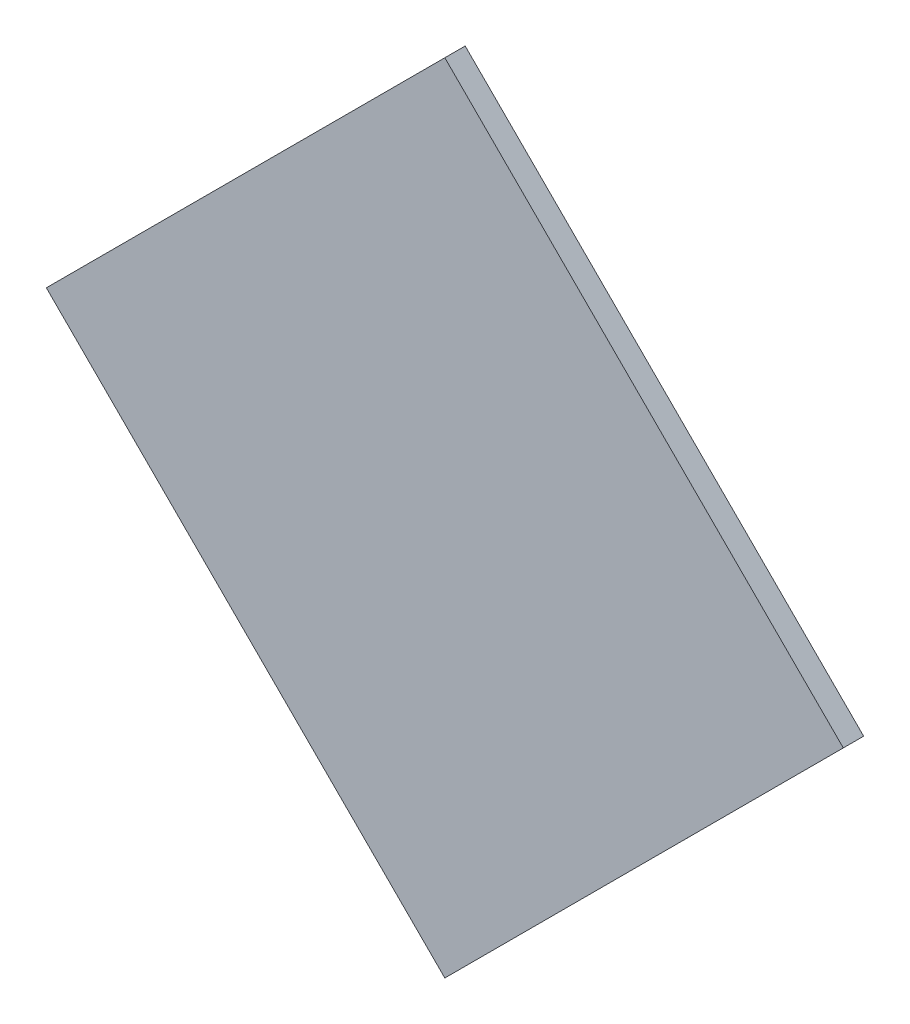
ISO-10303-21;
HEADER;
FILE_DESCRIPTION(('STEP AP214'),'2;1');
FILE_NAME('part.step','',(''),(''),'','','');
FILE_SCHEMA(('AUTOMOTIVE_DESIGN { 1 0 10303 214 1 1 1 1 }'));
ENDSEC;
DATA;
#1=APPLICATION_CONTEXT('core data for automotive mechanical design processes');
#2=APPLICATION_PROTOCOL_DEFINITION('international standard','automotive_design',2000,#1);
#3=PRODUCT_CONTEXT('',#1,'mechanical');
#4=PRODUCT('Part','Part','',(#3));
#5=PRODUCT_RELATED_PRODUCT_CATEGORY('part','',(#4));
#6=PRODUCT_DEFINITION_FORMATION('','',#4);
#7=PRODUCT_DEFINITION_CONTEXT('part definition',#1,'design');
#8=PRODUCT_DEFINITION('design','',#6,#7);
#9=PRODUCT_DEFINITION_SHAPE('','',#8);
#10=(LENGTH_UNIT() NAMED_UNIT(*) SI_UNIT(.MILLI.,.METRE.));
#11=(NAMED_UNIT(*) PLANE_ANGLE_UNIT() SI_UNIT($,.RADIAN.));
#12=(NAMED_UNIT(*) SI_UNIT($,.STERADIAN.) SOLID_ANGLE_UNIT());
#13=UNCERTAINTY_MEASURE_WITH_UNIT(LENGTH_MEASURE(1.E-05),#10,'distance_accuracy_value','');
#14=(GEOMETRIC_REPRESENTATION_CONTEXT(3) GLOBAL_UNCERTAINTY_ASSIGNED_CONTEXT((#13)) GLOBAL_UNIT_ASSIGNED_CONTEXT((#10,
#11,#12)) REPRESENTATION_CONTEXT('',''));
#15=CARTESIAN_POINT('',(0.,0.,0.));
#16=DIRECTION('',(0.,0.,1.));
#17=DIRECTION('',(1.,0.,0.));
#18=AXIS2_PLACEMENT_3D('',#15,#16,#17);
#19=CARTESIAN_POINT('',(7.226213583125,5.06167,0.76487));
#20=DIRECTION('',(0.,0.,-1.));
#21=DIRECTION('',(0.,1.,0.));
#22=AXIS2_PLACEMENT_3D('',#19,#20,#21);
#23=PLANE('',#22);
#24=DIRECTION('',(0.707106781186548,0.707106781186548,0.));
#25=VECTOR('',#24,1.);
#26=CARTESIAN_POINT('',(6.554462,5.06167,0.76487));
#27=LINE('',#26,#25);
#28=CARTESIAN_POINT('',(6.554462,5.06167,0.76487));
#29=VERTEX_POINT('',#28);
#30=CARTESIAN_POINT('',(7.226213333,5.733421333,0.76487));
#31=VERTEX_POINT('',#30);
#32=EDGE_CURVE('E55',#29,#31,#27,.T.);
#33=ORIENTED_EDGE('',*,*,#32,.T.);
#34=DIRECTION('',(0.70710713223896,-0.70710643013396,0.));
#35=VECTOR('',#34,1.);
#36=CARTESIAN_POINT('',(7.226213333,5.733421333,0.76487));
#37=LINE('',#36,#35);
#38=CARTESIAN_POINT('',(7.897965333,5.06167,0.76487));
#39=VERTEX_POINT('',#38);
#40=EDGE_CURVE('E57',#31,#39,#37,.T.);
#41=ORIENTED_EDGE('',*,*,#40,.T.);
#42=DIRECTION('',(-0.70710713223896,-0.70710643013396,0.));
#43=VECTOR('',#42,1.);
#44=CARTESIAN_POINT('',(7.897965333,5.06167,0.76487));
#45=LINE('',#44,#43);
#46=CARTESIAN_POINT('',(7.22621333300001,4.38991866699999,0.76487));
#47=VERTEX_POINT('',#46);
#48=EDGE_CURVE('E20',#39,#47,#45,.T.);
#49=ORIENTED_EDGE('',*,*,#48,.T.);
#50=DIRECTION('',(-0.707106781186548,0.707106781186548,0.));
#51=VECTOR('',#50,1.);
#52=CARTESIAN_POINT('',(7.226213333,4.389918667,0.76487));
#53=LINE('',#52,#51);
#54=EDGE_CURVE('E80',#47,#29,#53,.T.);
#55=ORIENTED_EDGE('',*,*,#54,.T.);
#56=EDGE_LOOP('',(#33,#41,#49,#55));
#57=FACE_BOUND('',#56,.T.);
#58=ADVANCED_FACE('F17',(#57),#23,.T.);
#59=CARTESIAN_POINT('',(7.897965333,5.06167,0.76487));
#60=DIRECTION('',(-0.70710643013396,0.70710713223896,0.));
#61=DIRECTION('',(-0.70710713223896,-0.70710643013396,0.));
#62=AXIS2_PLACEMENT_3D('',#59,#60,#61);
#63=PLANE('',#62);
#64=DIRECTION('',(0.,0.,1.));
#65=VECTOR('',#64,1.);
#66=CARTESIAN_POINT('',(7.226213333,4.389918667,0.76487));
#67=LINE('',#66,#65);
#68=CARTESIAN_POINT('',(7.22621333300001,4.38991866699999,0.79916));
#69=VERTEX_POINT('',#68);
#70=EDGE_CURVE('E68',#69,#47,#67,.F.);
#71=ORIENTED_EDGE('',*,*,#70,.T.);
#72=ORIENTED_EDGE('',*,*,#48,.F.);
#73=DIRECTION('',(0.,0.,1.));
#74=VECTOR('',#73,1.);
#75=CARTESIAN_POINT('',(7.89796533299999,5.06166999999999,0.76487));
#76=LINE('',#75,#74);
#77=CARTESIAN_POINT('',(7.897965333,5.06167,0.79916));
#78=VERTEX_POINT('',#77);
#79=EDGE_CURVE('E63',#39,#78,#76,.T.);
#80=ORIENTED_EDGE('',*,*,#79,.T.);
#81=DIRECTION('',(0.707107132238975,0.707106430133946,0.));
#82=VECTOR('',#81,1.);
#83=CARTESIAN_POINT('',(7.226213333,4.389918667,0.79916));
#84=LINE('',#83,#82);
#85=EDGE_CURVE('E83',#69,#78,#84,.T.);
#86=ORIENTED_EDGE('',*,*,#85,.F.);
#87=EDGE_LOOP('',(#71,#72,#80,#86));
#88=FACE_BOUND('',#87,.T.);
#89=ADVANCED_FACE('F65',(#88),#63,.F.);
#90=CARTESIAN_POINT('',(7.226213333,5.733421333,0.76487));
#91=DIRECTION('',(-0.70710643013396,-0.70710713223896,0.));
#92=DIRECTION('',(0.70710713223896,-0.70710643013396,0.));
#93=AXIS2_PLACEMENT_3D('',#90,#91,#92);
#94=PLANE('',#93);
#95=ORIENTED_EDGE('',*,*,#79,.F.);
#96=ORIENTED_EDGE('',*,*,#40,.F.);
#97=DIRECTION('',(0.,0.,1.));
#98=VECTOR('',#97,1.);
#99=CARTESIAN_POINT('',(7.226213333,5.733421333,0.76487));
#100=LINE('',#99,#98);
#101=CARTESIAN_POINT('',(7.226213333,5.733421333,0.79916));
#102=VERTEX_POINT('',#101);
#103=EDGE_CURVE('E75',#31,#102,#100,.T.);
#104=ORIENTED_EDGE('',*,*,#103,.T.);
#105=DIRECTION('',(-0.707107132238976,0.707106430133945,0.));
#106=VECTOR('',#105,1.);
#107=CARTESIAN_POINT('',(7.897965333,5.06167,0.79916));
#108=LINE('',#107,#106);
#109=EDGE_CURVE('E72',#78,#102,#108,.T.);
#110=ORIENTED_EDGE('',*,*,#109,.F.);
#111=EDGE_LOOP('',(#95,#96,#104,#110));
#112=FACE_BOUND('',#111,.T.);
#113=ADVANCED_FACE('F70',(#112),#94,.F.);
#114=CARTESIAN_POINT('',(6.554462,5.06167,0.76487));
#115=DIRECTION('',(0.707106781186548,-0.707106781186548,0.));
#116=DIRECTION('',(0.707106781186548,0.707106781186548,0.));
#117=AXIS2_PLACEMENT_3D('',#114,#115,#116);
#118=PLANE('',#117);
#119=ORIENTED_EDGE('',*,*,#103,.F.);
#120=ORIENTED_EDGE('',*,*,#32,.F.);
#121=DIRECTION('',(0.,0.,1.));
#122=VECTOR('',#121,1.);
#123=CARTESIAN_POINT('',(6.554462,5.06167,0.76487));
#124=LINE('',#123,#122);
#125=CARTESIAN_POINT('',(6.554462,5.06167,0.79916));
#126=VERTEX_POINT('',#125);
#127=EDGE_CURVE('E35',#29,#126,#124,.T.);
#128=ORIENTED_EDGE('',*,*,#127,.T.);
#129=DIRECTION('',(-0.707106781186548,-0.707106781186548,0.));
#130=VECTOR('',#129,1.);
#131=CARTESIAN_POINT('',(7.226213333,5.733421333,0.79916));
#132=LINE('',#131,#130);
#133=EDGE_CURVE('E26',#102,#126,#132,.T.);
#134=ORIENTED_EDGE('',*,*,#133,.F.);
#135=EDGE_LOOP('',(#119,#120,#128,#134));
#136=FACE_BOUND('',#135,.T.);
#137=ADVANCED_FACE('F89',(#136),#118,.F.);
#138=CARTESIAN_POINT('',(7.226213333,4.389918667,0.76487));
#139=DIRECTION('',(0.707106781186548,0.707106781186548,0.));
#140=DIRECTION('',(-0.707106781186548,0.707106781186548,0.));
#141=AXIS2_PLACEMENT_3D('',#138,#139,#140);
#142=PLANE('',#141);
#143=ORIENTED_EDGE('',*,*,#127,.F.);
#144=ORIENTED_EDGE('',*,*,#54,.F.);
#145=ORIENTED_EDGE('',*,*,#70,.F.);
#146=DIRECTION('',(0.707106781186547,-0.707106781186549,0.));
#147=VECTOR('',#146,1.);
#148=CARTESIAN_POINT('',(6.554462,5.06167,0.79916));
#149=LINE('',#148,#147);
#150=EDGE_CURVE('E11',#126,#69,#149,.T.);
#151=ORIENTED_EDGE('',*,*,#150,.F.);
#152=EDGE_LOOP('',(#143,#144,#145,#151));
#153=FACE_BOUND('',#152,.T.);
#154=ADVANCED_FACE('F91',(#153),#142,.F.);
#155=CARTESIAN_POINT('',(7.226213583125,5.06167,0.79916));
#156=DIRECTION('',(0.,0.,1.));
#157=DIRECTION('',(0.,-1.,0.));
#158=AXIS2_PLACEMENT_3D('',#155,#156,#157);
#159=PLANE('',#158);
#160=ORIENTED_EDGE('',*,*,#133,.T.);
#161=ORIENTED_EDGE('',*,*,#150,.T.);
#162=ORIENTED_EDGE('',*,*,#85,.T.);
#163=ORIENTED_EDGE('',*,*,#109,.T.);
#164=EDGE_LOOP('',(#160,#161,#162,#163));
#165=FACE_BOUND('',#164,.T.);
#166=ADVANCED_FACE('F88',(#165),#159,.T.);
#167=CLOSED_SHELL('',(#58,#89,#113,#137,#154,#166));
#168=MANIFOLD_SOLID_BREP('B1',#167);
#169=ADVANCED_BREP_SHAPE_REPRESENTATION('',(#18,#168),#14);
#170=SHAPE_DEFINITION_REPRESENTATION(#9,#169);
ENDSEC;
END-ISO-10303-21;
